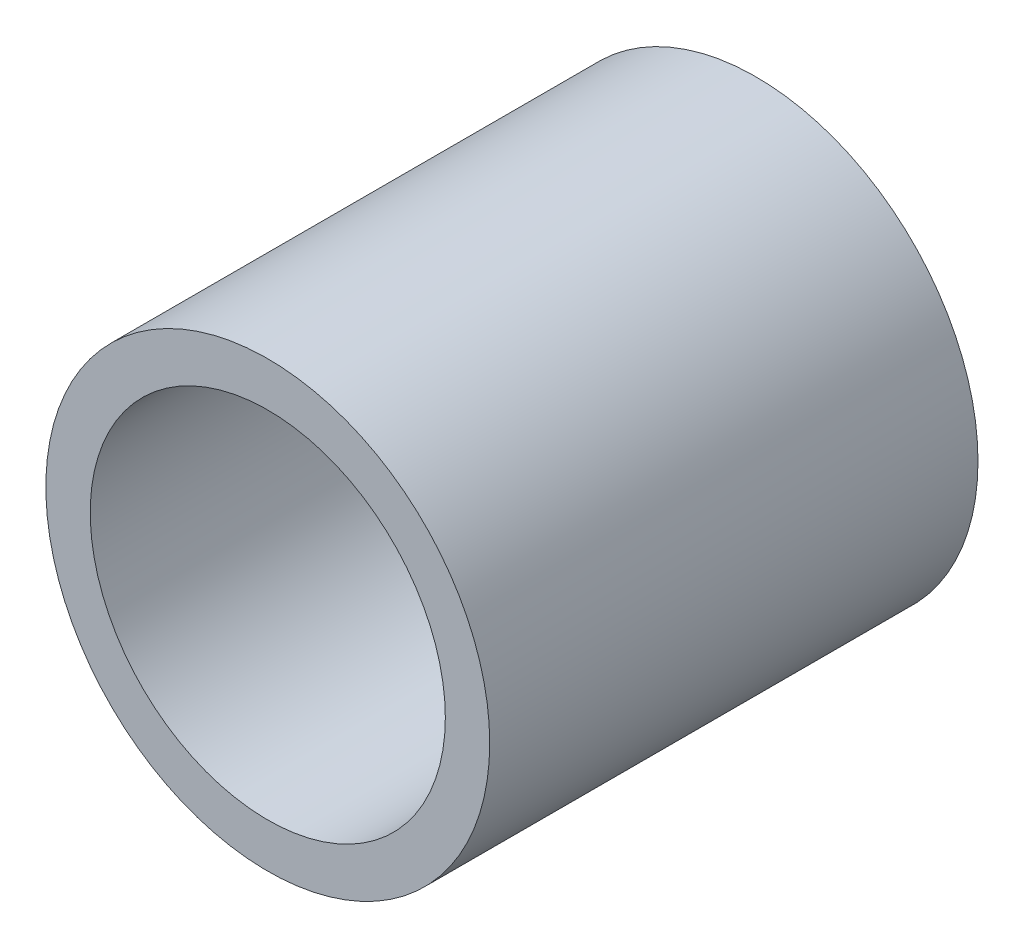
ISO-10303-21;
HEADER;
FILE_DESCRIPTION(('STEP AP214'),'2;1');
FILE_NAME('part.step','',(''),(''),'','','');
FILE_SCHEMA(('AUTOMOTIVE_DESIGN { 1 0 10303 214 1 1 1 1 }'));
ENDSEC;
DATA;
#1=APPLICATION_CONTEXT('core data for automotive mechanical design processes');
#2=APPLICATION_PROTOCOL_DEFINITION('international standard','automotive_design',2000,#1);
#3=PRODUCT_CONTEXT('',#1,'mechanical');
#4=PRODUCT('Part','Part','',(#3));
#5=PRODUCT_RELATED_PRODUCT_CATEGORY('part','',(#4));
#6=PRODUCT_DEFINITION_FORMATION('','',#4);
#7=PRODUCT_DEFINITION_CONTEXT('part definition',#1,'design');
#8=PRODUCT_DEFINITION('design','',#6,#7);
#9=PRODUCT_DEFINITION_SHAPE('','',#8);
#10=(LENGTH_UNIT() NAMED_UNIT(*) SI_UNIT(.MILLI.,.METRE.));
#11=(NAMED_UNIT(*) PLANE_ANGLE_UNIT() SI_UNIT($,.RADIAN.));
#12=(NAMED_UNIT(*) SI_UNIT($,.STERADIAN.) SOLID_ANGLE_UNIT());
#13=UNCERTAINTY_MEASURE_WITH_UNIT(LENGTH_MEASURE(1.E-05),#10,'distance_accuracy_value','');
#14=(GEOMETRIC_REPRESENTATION_CONTEXT(3) GLOBAL_UNCERTAINTY_ASSIGNED_CONTEXT((#13)) GLOBAL_UNIT_ASSIGNED_CONTEXT((#10,
#11,#12)) REPRESENTATION_CONTEXT('',''));
#15=CARTESIAN_POINT('',(0.,0.,0.));
#16=DIRECTION('',(0.,0.,1.));
#17=DIRECTION('',(1.,0.,0.));
#18=AXIS2_PLACEMENT_3D('',#15,#16,#17);
#19=CARTESIAN_POINT('',(0.,0.,1.375));
#20=DIRECTION('',(0.,0.,1.));
#21=DIRECTION('',(1.,0.,0.));
#22=AXIS2_PLACEMENT_3D('',#19,#20,#21);
#23=PLANE('',#22);
#24=CARTESIAN_POINT('',(0.,0.,1.375));
#25=DIRECTION('',(0.,0.,1.));
#26=DIRECTION('',(1.,0.,0.));
#27=AXIS2_PLACEMENT_3D('',#24,#25,#26);
#28=CIRCLE('',#27,0.625);
#29=CARTESIAN_POINT('',(0.625,0.,1.375));
#30=VERTEX_POINT('',#29);
#31=EDGE_CURVE('E10',#30,#30,#28,.T.);
#32=ORIENTED_EDGE('',*,*,#31,.T.);
#33=EDGE_LOOP('',(#32));
#34=FACE_BOUND('',#33,.T.);
#35=CARTESIAN_POINT('',(0.,0.,1.375));
#36=DIRECTION('',(0.,0.,1.));
#37=DIRECTION('',(1.,0.,0.));
#38=AXIS2_PLACEMENT_3D('',#35,#36,#37);
#39=CIRCLE('',#38,0.5);
#40=CARTESIAN_POINT('',(0.5,0.,1.375));
#41=VERTEX_POINT('',#40);
#42=EDGE_CURVE('E46',#41,#41,#39,.T.);
#43=ORIENTED_EDGE('',*,*,#42,.F.);
#44=EDGE_LOOP('',(#43));
#45=FACE_BOUND('',#44,.T.);
#46=ADVANCED_FACE('F35',(#34,#45),#23,.T.);
#47=CARTESIAN_POINT('',(0.,0.,0.));
#48=DIRECTION('',(0.,0.,1.));
#49=DIRECTION('',(1.,0.,0.));
#50=AXIS2_PLACEMENT_3D('',#47,#48,#49);
#51=PLANE('',#50);
#52=CARTESIAN_POINT('',(0.,0.,0.));
#53=DIRECTION('',(0.,0.,1.));
#54=DIRECTION('',(1.,0.,0.));
#55=AXIS2_PLACEMENT_3D('',#52,#53,#54);
#56=CIRCLE('',#55,0.625);
#57=CARTESIAN_POINT('',(0.625,0.,0.));
#58=VERTEX_POINT('',#57);
#59=EDGE_CURVE('E39',#58,#58,#56,.T.);
#60=ORIENTED_EDGE('',*,*,#59,.F.);
#61=EDGE_LOOP('',(#60));
#62=FACE_BOUND('',#61,.T.);
#63=CARTESIAN_POINT('',(0.,0.,0.));
#64=DIRECTION('',(0.,0.,1.));
#65=DIRECTION('',(1.,0.,0.));
#66=AXIS2_PLACEMENT_3D('',#63,#64,#65);
#67=CIRCLE('',#66,0.5);
#68=CARTESIAN_POINT('',(0.5,0.,0.));
#69=VERTEX_POINT('',#68);
#70=EDGE_CURVE('E48',#69,#69,#67,.T.);
#71=ORIENTED_EDGE('',*,*,#70,.T.);
#72=EDGE_LOOP('',(#71));
#73=FACE_BOUND('',#72,.T.);
#74=ADVANCED_FACE('F58',(#62,#73),#51,.F.);
#75=CARTESIAN_POINT('',(0.,0.,1.375));
#76=DIRECTION('',(0.,0.,-1.));
#77=DIRECTION('',(-1.,0.,0.));
#78=AXIS2_PLACEMENT_3D('',#75,#76,#77);
#79=CYLINDRICAL_SURFACE('',#78,0.625);
#80=ORIENTED_EDGE('',*,*,#31,.F.);
#81=EDGE_LOOP('',(#80));
#82=FACE_BOUND('',#81,.T.);
#83=ORIENTED_EDGE('',*,*,#59,.T.);
#84=EDGE_LOOP('',(#83));
#85=FACE_BOUND('',#84,.T.);
#86=ADVANCED_FACE('F37',(#82,#85),#79,.T.);
#87=CARTESIAN_POINT('',(0.,0.,1.375));
#88=DIRECTION('',(0.,0.,-1.));
#89=DIRECTION('',(-1.,0.,0.));
#90=AXIS2_PLACEMENT_3D('',#87,#88,#89);
#91=CYLINDRICAL_SURFACE('',#90,0.5);
#92=ORIENTED_EDGE('',*,*,#42,.T.);
#93=EDGE_LOOP('',(#92));
#94=FACE_BOUND('',#93,.T.);
#95=ORIENTED_EDGE('',*,*,#70,.F.);
#96=EDGE_LOOP('',(#95));
#97=FACE_BOUND('',#96,.T.);
#98=ADVANCED_FACE('F54',(#94,#97),#91,.F.);
#99=CLOSED_SHELL('',(#46,#74,#86,#98));
#100=MANIFOLD_SOLID_BREP('B2',#99);
#101=ADVANCED_BREP_SHAPE_REPRESENTATION('',(#18,#100),#14);
#102=SHAPE_DEFINITION_REPRESENTATION(#9,#101);
ENDSEC;
END-ISO-10303-21;
